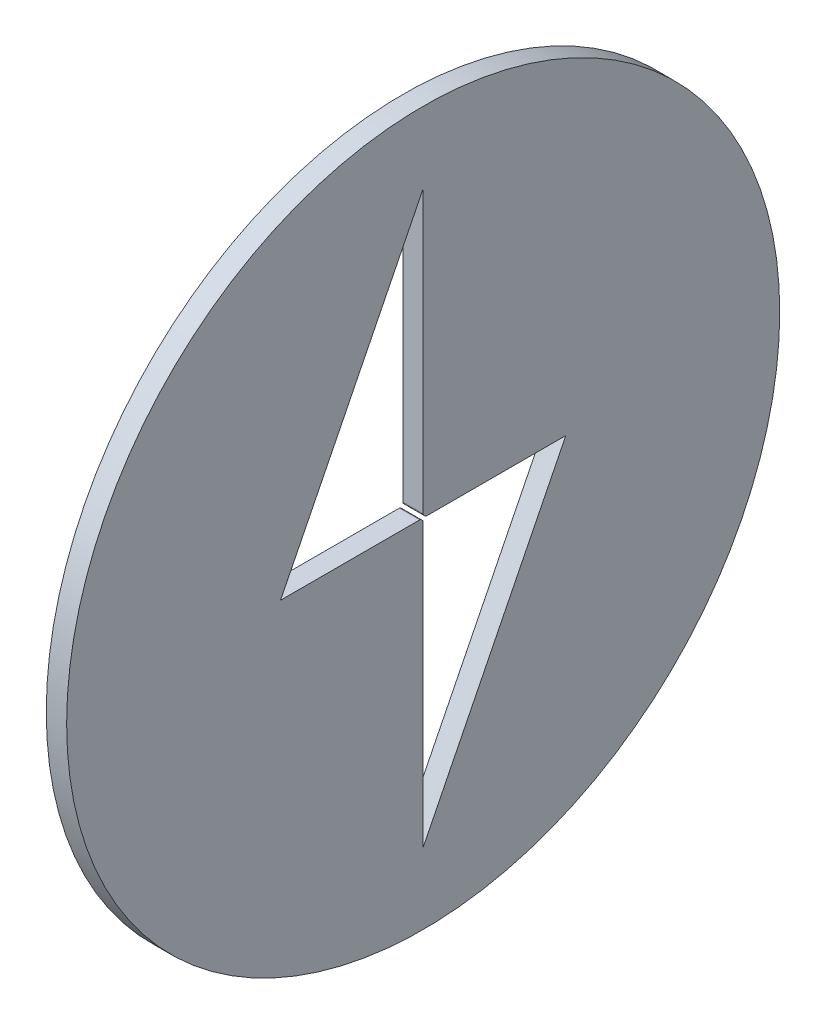
ISO-10303-21;
HEADER;
FILE_DESCRIPTION(('STEP AP214'),'2;1');
FILE_NAME('part.step','',(''),(''),'','','');
FILE_SCHEMA(('AUTOMOTIVE_DESIGN { 1 0 10303 214 1 1 1 1 }'));
ENDSEC;
DATA;
#1=APPLICATION_CONTEXT('core data for automotive mechanical design processes');
#2=APPLICATION_PROTOCOL_DEFINITION('international standard','automotive_design',2000,#1);
#3=PRODUCT_CONTEXT('',#1,'mechanical');
#4=PRODUCT('Part','Part','',(#3));
#5=PRODUCT_RELATED_PRODUCT_CATEGORY('part','',(#4));
#6=PRODUCT_DEFINITION_FORMATION('','',#4);
#7=PRODUCT_DEFINITION_CONTEXT('part definition',#1,'design');
#8=PRODUCT_DEFINITION('design','',#6,#7);
#9=PRODUCT_DEFINITION_SHAPE('','',#8);
#10=(LENGTH_UNIT() NAMED_UNIT(*) SI_UNIT(.MILLI.,.METRE.));
#11=(NAMED_UNIT(*) PLANE_ANGLE_UNIT() SI_UNIT($,.RADIAN.));
#12=(NAMED_UNIT(*) SI_UNIT($,.STERADIAN.) SOLID_ANGLE_UNIT());
#13=UNCERTAINTY_MEASURE_WITH_UNIT(LENGTH_MEASURE(1.E-05),#10,'distance_accuracy_value','');
#14=(GEOMETRIC_REPRESENTATION_CONTEXT(3) GLOBAL_UNCERTAINTY_ASSIGNED_CONTEXT((#13)) GLOBAL_UNIT_ASSIGNED_CONTEXT((#10,
#11,#12)) REPRESENTATION_CONTEXT('',''));
#15=CARTESIAN_POINT('',(0.,0.,0.));
#16=DIRECTION('',(0.,0.,1.));
#17=DIRECTION('',(1.,0.,0.));
#18=AXIS2_PLACEMENT_3D('',#15,#16,#17);
#19=CARTESIAN_POINT('',(-15.,173.25,-15.75));
#20=DIRECTION('',(1.,0.,0.));
#21=DIRECTION('',(0.,0.,-1.));
#22=AXIS2_PLACEMENT_3D('',#19,#20,#21);
#23=CYLINDRICAL_SURFACE('',#22,17.5);
#24=CARTESIAN_POINT('',(2.5,173.25,-15.75));
#25=DIRECTION('',(1.,0.,0.));
#26=DIRECTION('',(0.,0.,-1.));
#27=AXIS2_PLACEMENT_3D('',#24,#25,#26);
#28=CIRCLE('',#27,17.5);
#29=CARTESIAN_POINT('',(2.5,173.25,-33.25));
#30=VERTEX_POINT('',#29);
#31=EDGE_CURVE('E146',#30,#30,#28,.T.);
#32=ORIENTED_EDGE('',*,*,#31,.F.);
#33=EDGE_LOOP('',(#32));
#34=FACE_BOUND('',#33,.T.);
#35=CARTESIAN_POINT('',(1.5,173.25,-15.75));
#36=DIRECTION('',(-1.,0.,0.));
#37=DIRECTION('',(0.,0.,1.));
#38=AXIS2_PLACEMENT_3D('',#35,#36,#37);
#39=CIRCLE('',#38,17.5);
#40=CARTESIAN_POINT('',(1.5,173.25,1.75000000000002));
#41=VERTEX_POINT('',#40);
#42=EDGE_CURVE('E134',#41,#41,#39,.T.);
#43=ORIENTED_EDGE('',*,*,#42,.F.);
#44=EDGE_LOOP('',(#43));
#45=FACE_BOUND('',#44,.T.);
#46=ADVANCED_FACE('F36',(#34,#45),#23,.T.);
#47=CARTESIAN_POINT('',(0.,173.25,-15.9267766952967));
#48=DIRECTION('',(0.,1.,0.));
#49=DIRECTION('',(0.,0.,1.));
#50=AXIS2_PLACEMENT_3D('',#47,#48,#49);
#51=PLANE('',#50);
#52=DIRECTION('',(0.,0.,1.));
#53=VECTOR('',#52,1.);
#54=CARTESIAN_POINT('',(1.5,173.25,-15.9267766952967));
#55=LINE('',#54,#53);
#56=CARTESIAN_POINT('',(1.5,173.25,-22.75));
#57=VERTEX_POINT('',#56);
#58=CARTESIAN_POINT('',(1.5,173.25,-15.9267766952967));
#59=VERTEX_POINT('',#58);
#60=EDGE_CURVE('E50',#57,#59,#55,.T.);
#61=ORIENTED_EDGE('',*,*,#60,.F.);
#62=DIRECTION('',(1.,0.,0.));
#63=VECTOR('',#62,1.);
#64=CARTESIAN_POINT('',(0.,173.25,-22.75));
#65=LINE('',#64,#63);
#66=CARTESIAN_POINT('',(2.5,173.25,-22.75));
#67=VERTEX_POINT('',#66);
#68=EDGE_CURVE('E150',#57,#67,#65,.T.);
#69=ORIENTED_EDGE('',*,*,#68,.T.);
#70=DIRECTION('',(0.,0.,-1.));
#71=VECTOR('',#70,1.);
#72=CARTESIAN_POINT('',(2.5,173.25,0.));
#73=LINE('',#72,#71);
#74=CARTESIAN_POINT('',(2.5,173.25,-15.9267766952967));
#75=VERTEX_POINT('',#74);
#76=EDGE_CURVE('E161',#75,#67,#73,.T.);
#77=ORIENTED_EDGE('',*,*,#76,.F.);
#78=DIRECTION('',(1.,0.,0.));
#79=VECTOR('',#78,1.);
#80=CARTESIAN_POINT('',(0.,173.25,-15.9267766952967));
#81=LINE('',#80,#79);
#82=EDGE_CURVE('E57',#59,#75,#81,.T.);
#83=ORIENTED_EDGE('',*,*,#82,.F.);
#84=EDGE_LOOP('',(#61,#69,#77,#83));
#85=FACE_BOUND('',#84,.T.);
#86=ADVANCED_FACE('F217',(#85),#51,.F.);
#87=CARTESIAN_POINT('',(0.,173.25,-22.75));
#88=DIRECTION('',(0.,-0.447213595499958,-0.894427190999916));
#89=DIRECTION('',(0.,0.894427190999916,-0.447213595499958));
#90=AXIS2_PLACEMENT_3D('',#87,#88,#89);
#91=PLANE('',#90);
#92=DIRECTION('',(0.,0.894427190999916,-0.447213595499958));
#93=VECTOR('',#92,1.);
#94=CARTESIAN_POINT('',(1.5,173.25,-22.75));
#95=LINE('',#94,#93);
#96=CARTESIAN_POINT('',(1.5,159.25,-15.75));
#97=VERTEX_POINT('',#96);
#98=EDGE_CURVE('E226',#97,#57,#95,.T.);
#99=ORIENTED_EDGE('',*,*,#98,.F.);
#100=DIRECTION('',(1.,0.,0.));
#101=VECTOR('',#100,1.);
#102=CARTESIAN_POINT('',(0.,159.25,-15.75));
#103=LINE('',#102,#101);
#104=CARTESIAN_POINT('',(2.5,159.25,-15.75));
#105=VERTEX_POINT('',#104);
#106=EDGE_CURVE('E221',#97,#105,#103,.T.);
#107=ORIENTED_EDGE('',*,*,#106,.T.);
#108=DIRECTION('',(0.,-0.894427190999916,0.447213595499958));
#109=VECTOR('',#108,1.);
#110=CARTESIAN_POINT('',(2.5,25.55,51.1));
#111=LINE('',#110,#109);
#112=EDGE_CURVE('E164',#67,#105,#111,.T.);
#113=ORIENTED_EDGE('',*,*,#112,.F.);
#114=ORIENTED_EDGE('',*,*,#68,.F.);
#115=EDGE_LOOP('',(#99,#107,#113,#114));
#116=FACE_BOUND('',#115,.T.);
#117=ADVANCED_FACE('F223',(#116),#91,.F.);
#118=CARTESIAN_POINT('',(0.,159.25,-15.75));
#119=DIRECTION('',(0.,0.,1.));
#120=DIRECTION('',(1.,0.,0.));
#121=AXIS2_PLACEMENT_3D('',#118,#119,#120);
#122=PLANE('',#121);
#123=DIRECTION('',(0.,-1.,0.));
#124=VECTOR('',#123,1.);
#125=CARTESIAN_POINT('',(1.5,159.25,-15.75));
#126=LINE('',#125,#124);
#127=CARTESIAN_POINT('',(1.5,173.073223304703,-15.75));
#128=VERTEX_POINT('',#127);
#129=EDGE_CURVE('E251',#128,#97,#126,.T.);
#130=ORIENTED_EDGE('',*,*,#129,.F.);
#131=DIRECTION('',(1.,0.,0.));
#132=VECTOR('',#131,1.);
#133=CARTESIAN_POINT('',(0.,173.073223304703,-15.75));
#134=LINE('',#133,#132);
#135=CARTESIAN_POINT('',(2.5,173.073223304703,-15.75));
#136=VERTEX_POINT('',#135);
#137=EDGE_CURVE('E229',#128,#136,#134,.T.);
#138=ORIENTED_EDGE('',*,*,#137,.T.);
#139=DIRECTION('',(0.,1.,0.));
#140=VECTOR('',#139,1.);
#141=CARTESIAN_POINT('',(2.5,0.,-15.75));
#142=LINE('',#141,#140);
#143=EDGE_CURVE('E167',#105,#136,#142,.T.);
#144=ORIENTED_EDGE('',*,*,#143,.F.);
#145=ORIENTED_EDGE('',*,*,#106,.F.);
#146=EDGE_LOOP('',(#130,#138,#144,#145));
#147=FACE_BOUND('',#146,.T.);
#148=ADVANCED_FACE('F231',(#147),#122,.F.);
#149=CARTESIAN_POINT('',(0.,173.073223304703,-15.625));
#150=DIRECTION('',(1.,0.,0.));
#151=DIRECTION('',(0.,0.,-1.));
#152=AXIS2_PLACEMENT_3D('',#149,#150,#151);
#153=CYLINDRICAL_SURFACE('',#152,0.125000000000014);
#154=CARTESIAN_POINT('',(1.5,173.073223304703,-15.625));
#155=DIRECTION('',(-1.,0.,0.));
#156=DIRECTION('',(0.,0.,1.));
#157=AXIS2_PLACEMENT_3D('',#154,#155,#156);
#158=CIRCLE('',#157,0.125000000000014);
#159=CARTESIAN_POINT('',(1.5,173.161611652352,-15.7133883476483));
#160=VERTEX_POINT('',#159);
#161=EDGE_CURVE('E239',#160,#128,#158,.T.);
#162=ORIENTED_EDGE('',*,*,#161,.F.);
#163=DIRECTION('',(1.,0.,0.));
#164=VECTOR('',#163,1.);
#165=CARTESIAN_POINT('',(0.,173.161611652352,-15.7133883476483));
#166=LINE('',#165,#164);
#167=CARTESIAN_POINT('',(2.5,173.161611652352,-15.7133883476483));
#168=VERTEX_POINT('',#167);
#169=EDGE_CURVE('E238',#160,#168,#166,.T.);
#170=ORIENTED_EDGE('',*,*,#169,.T.);
#171=CARTESIAN_POINT('',(2.5,173.073223304703,-15.625));
#172=DIRECTION('',(1.,0.,0.));
#173=DIRECTION('',(0.,0.,-1.));
#174=AXIS2_PLACEMENT_3D('',#171,#172,#173);
#175=CIRCLE('',#174,0.125);
#176=EDGE_CURVE('E177',#136,#168,#175,.T.);
#177=ORIENTED_EDGE('',*,*,#176,.F.);
#178=ORIENTED_EDGE('',*,*,#137,.F.);
#179=EDGE_LOOP('',(#162,#170,#177,#178));
#180=FACE_BOUND('',#179,.T.);
#181=ADVANCED_FACE('F236',(#180),#153,.T.);
#182=CARTESIAN_POINT('',(0.,173.213388347648,-15.6616116523517));
#183=DIRECTION('',(0.,-0.707106781186642,0.707106781186453));
#184=DIRECTION('',(0.,-0.707106781186453,-0.707106781186642));
#185=AXIS2_PLACEMENT_3D('',#182,#183,#184);
#186=PLANE('',#185);
#187=DIRECTION('',(0.,-0.707106781186453,-0.707106781186642));
#188=VECTOR('',#187,1.);
#189=CARTESIAN_POINT('',(1.5,173.213388347648,-15.6616116523517));
#190=LINE('',#189,#188);
#191=CARTESIAN_POINT('',(1.5,173.213388347648,-15.6616116523517));
#192=VERTEX_POINT('',#191);
#193=EDGE_CURVE('E244',#192,#160,#190,.T.);
#194=ORIENTED_EDGE('',*,*,#193,.F.);
#195=DIRECTION('',(1.,0.,0.));
#196=VECTOR('',#195,1.);
#197=CARTESIAN_POINT('',(0.,173.213388347648,-15.6616116523517));
#198=LINE('',#197,#196);
#199=CARTESIAN_POINT('',(2.5,173.213388347648,-15.6616116523517));
#200=VERTEX_POINT('',#199);
#201=EDGE_CURVE('E189',#192,#200,#198,.T.);
#202=ORIENTED_EDGE('',*,*,#201,.T.);
#203=DIRECTION('',(0.,-0.707106781186508,-0.707106781186587));
#204=VECTOR('',#203,1.);
#205=CARTESIAN_POINT('',(2.5,94.4375000000096,-94.4374999999991));
#206=LINE('',#205,#204);
#207=EDGE_CURVE('E170',#200,#168,#206,.T.);
#208=ORIENTED_EDGE('',*,*,#207,.T.);
#209=ORIENTED_EDGE('',*,*,#169,.F.);
#210=EDGE_LOOP('',(#194,#202,#208,#209));
#211=FACE_BOUND('',#210,.T.);
#212=ADVANCED_FACE('F243',(#211),#186,.F.);
#213=CARTESIAN_POINT('',(0.,173.125,-15.5732233047034));
#214=DIRECTION('',(1.,0.,0.));
#215=DIRECTION('',(0.,0.,-1.));
#216=AXIS2_PLACEMENT_3D('',#213,#214,#215);
#217=CYLINDRICAL_SURFACE('',#216,0.124999999999995);
#218=CARTESIAN_POINT('',(1.5,173.125,-15.5732233047034));
#219=DIRECTION('',(-1.,0.,0.));
#220=DIRECTION('',(0.,0.,1.));
#221=AXIS2_PLACEMENT_3D('',#218,#219,#220);
#222=CIRCLE('',#221,0.124999999999995);
#223=CARTESIAN_POINT('',(1.5,173.25,-15.5732233047034));
#224=VERTEX_POINT('',#223);
#225=EDGE_CURVE('E192',#224,#192,#222,.T.);
#226=ORIENTED_EDGE('',*,*,#225,.F.);
#227=DIRECTION('',(1.,0.,0.));
#228=VECTOR('',#227,1.);
#229=CARTESIAN_POINT('',(0.,173.25,-15.5732233047034));
#230=LINE('',#229,#228);
#231=CARTESIAN_POINT('',(2.5,173.25,-15.5732233047034));
#232=VERTEX_POINT('',#231);
#233=EDGE_CURVE('E191',#224,#232,#230,.T.);
#234=ORIENTED_EDGE('',*,*,#233,.T.);
#235=CARTESIAN_POINT('',(2.5,173.125,-15.5732233047034));
#236=DIRECTION('',(1.,0.,0.));
#237=DIRECTION('',(0.,0.,-1.));
#238=AXIS2_PLACEMENT_3D('',#235,#236,#237);
#239=CIRCLE('',#238,0.125);
#240=EDGE_CURVE('E44',#200,#232,#239,.T.);
#241=ORIENTED_EDGE('',*,*,#240,.F.);
#242=ORIENTED_EDGE('',*,*,#201,.F.);
#243=EDGE_LOOP('',(#226,#234,#241,#242));
#244=FACE_BOUND('',#243,.T.);
#245=ADVANCED_FACE('F188',(#244),#217,.T.);
#246=CARTESIAN_POINT('',(0.,173.25,-15.5732233047034));
#247=DIRECTION('',(0.,-1.,0.));
#248=DIRECTION('',(0.,0.,-1.));
#249=AXIS2_PLACEMENT_3D('',#246,#247,#248);
#250=PLANE('',#249);
#251=DIRECTION('',(0.,0.,-1.));
#252=VECTOR('',#251,1.);
#253=CARTESIAN_POINT('',(1.5,173.25,-15.5732233047034));
#254=LINE('',#253,#252);
#255=CARTESIAN_POINT('',(1.5,173.25,-8.75000000000001));
#256=VERTEX_POINT('',#255);
#257=EDGE_CURVE('E199',#256,#224,#254,.T.);
#258=ORIENTED_EDGE('',*,*,#257,.F.);
#259=DIRECTION('',(1.,0.,0.));
#260=VECTOR('',#259,1.);
#261=CARTESIAN_POINT('',(0.,173.25,-8.75000000000001));
#262=LINE('',#261,#260);
#263=CARTESIAN_POINT('',(2.5,173.25,-8.75000000000001));
#264=VERTEX_POINT('',#263);
#265=EDGE_CURVE('E195',#256,#264,#262,.T.);
#266=ORIENTED_EDGE('',*,*,#265,.T.);
#267=DIRECTION('',(0.,0.,1.));
#268=VECTOR('',#267,1.);
#269=CARTESIAN_POINT('',(2.5,173.25,0.));
#270=LINE('',#269,#268);
#271=EDGE_CURVE('E149',#232,#264,#270,.T.);
#272=ORIENTED_EDGE('',*,*,#271,.F.);
#273=ORIENTED_EDGE('',*,*,#233,.F.);
#274=EDGE_LOOP('',(#258,#266,#272,#273));
#275=FACE_BOUND('',#274,.T.);
#276=ADVANCED_FACE('F197',(#275),#250,.F.);
#277=CARTESIAN_POINT('',(0.,187.25,-15.75));
#278=DIRECTION('',(0.,0.447213595499957,0.894427190999917));
#279=DIRECTION('',(0.,-0.894427190999917,0.447213595499957));
#280=AXIS2_PLACEMENT_3D('',#277,#278,#279);
#281=PLANE('',#280);
#282=DIRECTION('',(0.,-0.894427190999917,0.447213595499957));
#283=VECTOR('',#282,1.);
#284=CARTESIAN_POINT('',(1.5,187.25,-15.75));
#285=LINE('',#284,#283);
#286=CARTESIAN_POINT('',(1.5,187.25,-15.75));
#287=VERTEX_POINT('',#286);
#288=EDGE_CURVE('E257',#287,#256,#285,.T.);
#289=ORIENTED_EDGE('',*,*,#288,.F.);
#290=DIRECTION('',(1.,0.,0.));
#291=VECTOR('',#290,1.);
#292=CARTESIAN_POINT('',(0.,187.25,-15.75));
#293=LINE('',#292,#291);
#294=CARTESIAN_POINT('',(2.5,187.25,-15.75));
#295=VERTEX_POINT('',#294);
#296=EDGE_CURVE('E202',#287,#295,#293,.T.);
#297=ORIENTED_EDGE('',*,*,#296,.T.);
#298=DIRECTION('',(0.,-0.894427190999916,0.447213595499958));
#299=VECTOR('',#298,1.);
#300=CARTESIAN_POINT('',(2.5,31.1499999999999,62.2999999999999));
#301=LINE('',#300,#299);
#302=EDGE_CURVE('E153',#295,#264,#301,.T.);
#303=ORIENTED_EDGE('',*,*,#302,.T.);
#304=ORIENTED_EDGE('',*,*,#265,.F.);
#305=EDGE_LOOP('',(#289,#297,#303,#304));
#306=FACE_BOUND('',#305,.T.);
#307=ADVANCED_FACE('F204',(#306),#281,.F.);
#308=CARTESIAN_POINT('',(0.,173.426776695297,-15.75));
#309=DIRECTION('',(0.,0.,-1.));
#310=DIRECTION('',(0.,1.,0.));
#311=AXIS2_PLACEMENT_3D('',#308,#309,#310);
#312=PLANE('',#311);
#313=DIRECTION('',(0.,1.,0.));
#314=VECTOR('',#313,1.);
#315=CARTESIAN_POINT('',(1.5,173.426776695297,-15.75));
#316=LINE('',#315,#314);
#317=CARTESIAN_POINT('',(1.5,173.426776695297,-15.75));
#318=VERTEX_POINT('',#317);
#319=EDGE_CURVE('E212',#318,#287,#316,.T.);
#320=ORIENTED_EDGE('',*,*,#319,.F.);
#321=DIRECTION('',(1.,0.,0.));
#322=VECTOR('',#321,1.);
#323=CARTESIAN_POINT('',(0.,173.426776695297,-15.75));
#324=LINE('',#323,#322);
#325=CARTESIAN_POINT('',(2.5,173.426776695297,-15.75));
#326=VERTEX_POINT('',#325);
#327=EDGE_CURVE('E141',#318,#326,#324,.T.);
#328=ORIENTED_EDGE('',*,*,#327,.T.);
#329=DIRECTION('',(0.,1.,0.));
#330=VECTOR('',#329,1.);
#331=CARTESIAN_POINT('',(2.5,0.,-15.75));
#332=LINE('',#331,#330);
#333=EDGE_CURVE('E156',#326,#295,#332,.T.);
#334=ORIENTED_EDGE('',*,*,#333,.T.);
#335=ORIENTED_EDGE('',*,*,#296,.F.);
#336=EDGE_LOOP('',(#320,#328,#334,#335));
#337=FACE_BOUND('',#336,.T.);
#338=ADVANCED_FACE('F210',(#337),#312,.F.);
#339=CARTESIAN_POINT('',(0.,173.426776695297,-15.875));
#340=DIRECTION('',(1.,0.,0.));
#341=DIRECTION('',(0.,0.,-1.));
#342=AXIS2_PLACEMENT_3D('',#339,#340,#341);
#343=CYLINDRICAL_SURFACE('',#342,0.124999999999997);
#344=CARTESIAN_POINT('',(1.5,173.426776695297,-15.875));
#345=DIRECTION('',(-1.,0.,0.));
#346=DIRECTION('',(0.,0.,1.));
#347=AXIS2_PLACEMENT_3D('',#344,#345,#346);
#348=CIRCLE('',#347,0.124999999999997);
#349=CARTESIAN_POINT('',(1.5,173.338388347648,-15.7866116523517));
#350=VERTEX_POINT('',#349);
#351=EDGE_CURVE('E133',#350,#318,#348,.T.);
#352=ORIENTED_EDGE('',*,*,#351,.F.);
#353=DIRECTION('',(1.,0.,0.));
#354=VECTOR('',#353,1.);
#355=CARTESIAN_POINT('',(0.,173.338388347648,-15.7866116523517));
#356=LINE('',#355,#354);
#357=CARTESIAN_POINT('',(2.5,173.338388347648,-15.7866116523517));
#358=VERTEX_POINT('',#357);
#359=EDGE_CURVE('E132',#350,#358,#356,.T.);
#360=ORIENTED_EDGE('',*,*,#359,.T.);
#361=CARTESIAN_POINT('',(2.5,173.426776695297,-15.875));
#362=DIRECTION('',(1.,0.,0.));
#363=DIRECTION('',(0.,0.,-1.));
#364=AXIS2_PLACEMENT_3D('',#361,#362,#363);
#365=CIRCLE('',#364,0.125);
#366=EDGE_CURVE('E173',#326,#358,#365,.T.);
#367=ORIENTED_EDGE('',*,*,#366,.F.);
#368=ORIENTED_EDGE('',*,*,#327,.F.);
#369=EDGE_LOOP('',(#352,#360,#367,#368));
#370=FACE_BOUND('',#369,.T.);
#371=ADVANCED_FACE('F214',(#370),#343,.T.);
#372=CARTESIAN_POINT('',(0.,173.338388347648,-15.7866116523517));
#373=DIRECTION('',(0.,0.707106781186548,-0.707106781186548));
#374=DIRECTION('',(0.,0.707106781186548,0.707106781186548));
#375=AXIS2_PLACEMENT_3D('',#372,#373,#374);
#376=PLANE('',#375);
#377=DIRECTION('',(0.,0.707106781186548,0.707106781186548));
#378=VECTOR('',#377,1.);
#379=CARTESIAN_POINT('',(1.5,173.338388347648,-15.7866116523517));
#380=LINE('',#379,#378);
#381=CARTESIAN_POINT('',(1.5,173.286611652352,-15.8383883476484));
#382=VERTEX_POINT('',#381);
#383=EDGE_CURVE('E124',#382,#350,#380,.T.);
#384=ORIENTED_EDGE('',*,*,#383,.F.);
#385=DIRECTION('',(1.,0.,0.));
#386=VECTOR('',#385,1.);
#387=CARTESIAN_POINT('',(0.,173.286611652352,-15.8383883476483));
#388=LINE('',#387,#386);
#389=CARTESIAN_POINT('',(2.5,173.286611652352,-15.8383883476483));
#390=VERTEX_POINT('',#389);
#391=EDGE_CURVE('E131',#382,#390,#388,.T.);
#392=ORIENTED_EDGE('',*,*,#391,.T.);
#393=DIRECTION('',(0.,-0.707106781186499,-0.707106781186597));
#394=VECTOR('',#393,1.);
#395=CARTESIAN_POINT('',(2.5,94.562500000012,-94.5624999999989));
#396=LINE('',#395,#394);
#397=EDGE_CURVE('E159',#358,#390,#396,.T.);
#398=ORIENTED_EDGE('',*,*,#397,.F.);
#399=ORIENTED_EDGE('',*,*,#359,.F.);
#400=EDGE_LOOP('',(#384,#392,#398,#399));
#401=FACE_BOUND('',#400,.T.);
#402=ADVANCED_FACE('F129',(#401),#376,.F.);
#403=CARTESIAN_POINT('',(0.,173.375,-15.9267766952967));
#404=DIRECTION('',(1.,0.,0.));
#405=DIRECTION('',(0.,0.,-1.));
#406=AXIS2_PLACEMENT_3D('',#403,#404,#405);
#407=CYLINDRICAL_SURFACE('',#406,0.124999999999993);
#408=CARTESIAN_POINT('',(1.5,173.375,-15.9267766952967));
#409=DIRECTION('',(-1.,0.,0.));
#410=DIRECTION('',(0.,0.,1.));
#411=AXIS2_PLACEMENT_3D('',#408,#409,#410);
#412=CIRCLE('',#411,0.124999999999993);
#413=EDGE_CURVE('E12',#59,#382,#412,.T.);
#414=ORIENTED_EDGE('',*,*,#413,.F.);
#415=ORIENTED_EDGE('',*,*,#82,.T.);
#416=CARTESIAN_POINT('',(2.5,173.375,-15.9267766952967));
#417=DIRECTION('',(1.,0.,0.));
#418=DIRECTION('',(0.,0.,-1.));
#419=AXIS2_PLACEMENT_3D('',#416,#417,#418);
#420=CIRCLE('',#419,0.125);
#421=EDGE_CURVE('E138',#390,#75,#420,.T.);
#422=ORIENTED_EDGE('',*,*,#421,.F.);
#423=ORIENTED_EDGE('',*,*,#391,.F.);
#424=EDGE_LOOP('',(#414,#415,#422,#423));
#425=FACE_BOUND('',#424,.T.);
#426=ADVANCED_FACE('F136',(#425),#407,.T.);
#427=CARTESIAN_POINT('',(2.5,0.,0.));
#428=DIRECTION('',(1.,0.,0.));
#429=DIRECTION('',(0.,0.,-1.));
#430=AXIS2_PLACEMENT_3D('',#427,#428,#429);
#431=PLANE('',#430);
#432=ORIENTED_EDGE('',*,*,#31,.T.);
#433=EDGE_LOOP('',(#432));
#434=FACE_BOUND('',#433,.T.);
#435=ORIENTED_EDGE('',*,*,#207,.F.);
#436=ORIENTED_EDGE('',*,*,#240,.T.);
#437=ORIENTED_EDGE('',*,*,#271,.T.);
#438=ORIENTED_EDGE('',*,*,#302,.F.);
#439=ORIENTED_EDGE('',*,*,#333,.F.);
#440=ORIENTED_EDGE('',*,*,#366,.T.);
#441=ORIENTED_EDGE('',*,*,#397,.T.);
#442=ORIENTED_EDGE('',*,*,#421,.T.);
#443=ORIENTED_EDGE('',*,*,#76,.T.);
#444=ORIENTED_EDGE('',*,*,#112,.T.);
#445=ORIENTED_EDGE('',*,*,#143,.T.);
#446=ORIENTED_EDGE('',*,*,#176,.T.);
#447=EDGE_LOOP('',(#435,#436,#437,#438,#439,#440,#441,#442,#443,#444,#445,#446));
#448=FACE_BOUND('',#447,.T.);
#449=ADVANCED_FACE('F38',(#434,#448),#431,.T.);
#450=CARTESIAN_POINT('',(1.5,173.25,-15.75));
#451=DIRECTION('',(-1.,0.,0.));
#452=DIRECTION('',(0.,0.,1.));
#453=AXIS2_PLACEMENT_3D('',#450,#451,#452);
#454=PLANE('',#453);
#455=ORIENTED_EDGE('',*,*,#42,.T.);
#456=EDGE_LOOP('',(#455));
#457=FACE_BOUND('',#456,.T.);
#458=ORIENTED_EDGE('',*,*,#60,.T.);
#459=ORIENTED_EDGE('',*,*,#413,.T.);
#460=ORIENTED_EDGE('',*,*,#383,.T.);
#461=ORIENTED_EDGE('',*,*,#351,.T.);
#462=ORIENTED_EDGE('',*,*,#319,.T.);
#463=ORIENTED_EDGE('',*,*,#288,.T.);
#464=ORIENTED_EDGE('',*,*,#257,.T.);
#465=ORIENTED_EDGE('',*,*,#225,.T.);
#466=ORIENTED_EDGE('',*,*,#193,.T.);
#467=ORIENTED_EDGE('',*,*,#161,.T.);
#468=ORIENTED_EDGE('',*,*,#129,.T.);
#469=ORIENTED_EDGE('',*,*,#98,.T.);
#470=EDGE_LOOP('',(#458,#459,#460,#461,#462,#463,#464,#465,#466,#467,#468,#469));
#471=FACE_BOUND('',#470,.T.);
#472=ADVANCED_FACE('F123',(#457,#471),#454,.T.);
#473=CLOSED_SHELL('',(#46,#86,#117,#148,#181,#212,#245,#276,#307,#338,#371,#402,#426,#449,#472));
#474=MANIFOLD_SOLID_BREP('B2',#473);
#475=ADVANCED_BREP_SHAPE_REPRESENTATION('',(#18,#474),#14);
#476=SHAPE_DEFINITION_REPRESENTATION(#9,#475);
ENDSEC;
END-ISO-10303-21;
